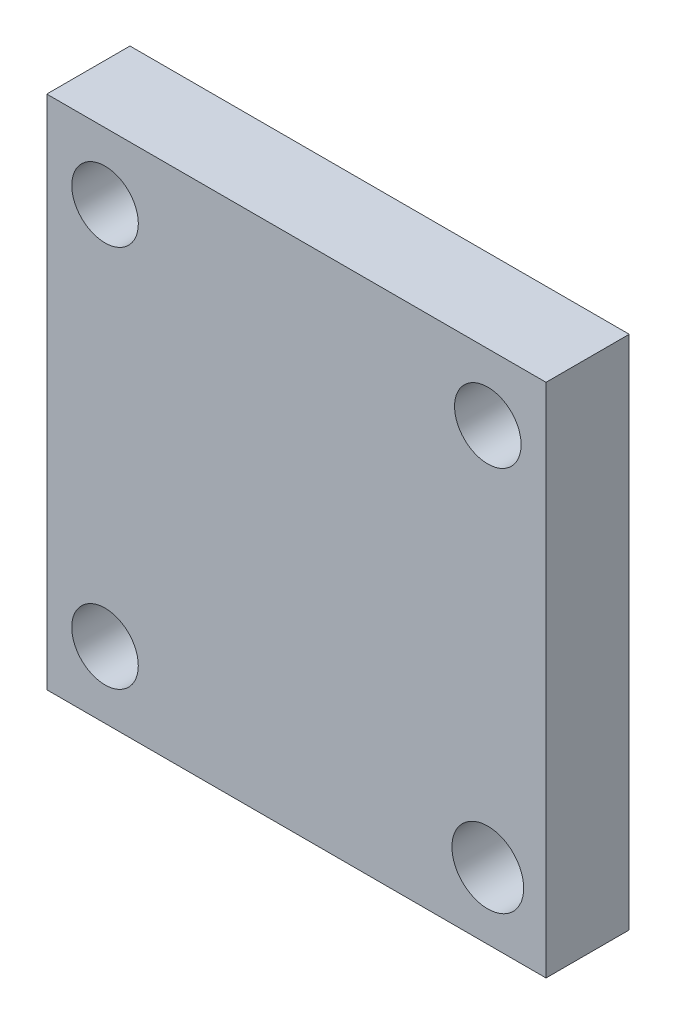
ISO-10303-21;
HEADER;
FILE_DESCRIPTION(('STEP AP214'),'2;1');
FILE_NAME('part.step','',(''),(''),'','','');
FILE_SCHEMA(('AUTOMOTIVE_DESIGN { 1 0 10303 214 1 1 1 1 }'));
ENDSEC;
DATA;
#1=APPLICATION_CONTEXT('core data for automotive mechanical design processes');
#2=APPLICATION_PROTOCOL_DEFINITION('international standard','automotive_design',2000,#1);
#3=PRODUCT_CONTEXT('',#1,'mechanical');
#4=PRODUCT('Part','Part','',(#3));
#5=PRODUCT_RELATED_PRODUCT_CATEGORY('part','',(#4));
#6=PRODUCT_DEFINITION_FORMATION('','',#4);
#7=PRODUCT_DEFINITION_CONTEXT('part definition',#1,'design');
#8=PRODUCT_DEFINITION('design','',#6,#7);
#9=PRODUCT_DEFINITION_SHAPE('','',#8);
#10=(LENGTH_UNIT() NAMED_UNIT(*) SI_UNIT(.MILLI.,.METRE.));
#11=(NAMED_UNIT(*) PLANE_ANGLE_UNIT() SI_UNIT($,.RADIAN.));
#12=(NAMED_UNIT(*) SI_UNIT($,.STERADIAN.) SOLID_ANGLE_UNIT());
#13=UNCERTAINTY_MEASURE_WITH_UNIT(LENGTH_MEASURE(1.E-05),#10,'distance_accuracy_value','');
#14=(GEOMETRIC_REPRESENTATION_CONTEXT(3) GLOBAL_UNCERTAINTY_ASSIGNED_CONTEXT((#13)) GLOBAL_UNIT_ASSIGNED_CONTEXT((#10,
#11,#12)) REPRESENTATION_CONTEXT('',''));
#15=CARTESIAN_POINT('',(0.,0.,0.));
#16=DIRECTION('',(0.,0.,1.));
#17=DIRECTION('',(1.,0.,0.));
#18=AXIS2_PLACEMENT_3D('',#15,#16,#17);
#19=CARTESIAN_POINT('',(0.,0.,5.));
#20=DIRECTION('',(0.,0.,1.));
#21=DIRECTION('',(1.,0.,0.));
#22=AXIS2_PLACEMENT_3D('',#19,#20,#21);
#23=PLANE('',#22);
#24=CARTESIAN_POINT('',(-11.501091744182,-11.4989082558181,5.));
#25=DIRECTION('',(0.,0.,1.));
#26=DIRECTION('',(1.,0.,0.));
#27=AXIS2_PLACEMENT_3D('',#24,#25,#26);
#28=CIRCLE('',#27,2.);
#29=CARTESIAN_POINT('',(-9.50109174418201,-11.4989082558181,5.));
#30=VERTEX_POINT('',#29);
#31=EDGE_CURVE('E142',#30,#30,#28,.T.);
#32=ORIENTED_EDGE('',*,*,#31,.F.);
#33=EDGE_LOOP('',(#32));
#34=FACE_BOUND('',#33,.T.);
#35=CARTESIAN_POINT('',(-11.4989082558179,11.5032752325463,5.));
#36=DIRECTION('',(0.,0.,1.));
#37=DIRECTION('',(1.,0.,0.));
#38=AXIS2_PLACEMENT_3D('',#35,#36,#37);
#39=CIRCLE('',#38,2.);
#40=CARTESIAN_POINT('',(-9.49890825581793,11.5032752325463,5.));
#41=VERTEX_POINT('',#40);
#42=EDGE_CURVE('E112',#41,#41,#39,.T.);
#43=ORIENTED_EDGE('',*,*,#42,.F.);
#44=EDGE_LOOP('',(#43));
#45=FACE_BOUND('',#44,.T.);
#46=DIRECTION('',(0.,1.,0.));
#47=VECTOR('',#46,1.);
#48=CARTESIAN_POINT('',(15.001091744182,-15.5010917441821,5.));
#49=LINE('',#48,#47);
#50=CARTESIAN_POINT('',(15.001091744182,-15.5010917441821,5.));
#51=VERTEX_POINT('',#50);
#52=CARTESIAN_POINT('',(15.001091744182,15.5010917441821,5.));
#53=VERTEX_POINT('',#52);
#54=EDGE_CURVE('E92',#51,#53,#49,.T.);
#55=ORIENTED_EDGE('',*,*,#54,.T.);
#56=DIRECTION('',(-1.,0.,0.));
#57=VECTOR('',#56,1.);
#58=CARTESIAN_POINT('',(15.001091744182,15.5010917441821,5.));
#59=LINE('',#58,#57);
#60=CARTESIAN_POINT('',(-15.001091744182,15.5010917441821,5.));
#61=VERTEX_POINT('',#60);
#62=EDGE_CURVE('E87',#53,#61,#59,.T.);
#63=ORIENTED_EDGE('',*,*,#62,.T.);
#64=DIRECTION('',(0.,-1.,0.));
#65=VECTOR('',#64,1.);
#66=CARTESIAN_POINT('',(-15.001091744182,-15.5010917441821,5.));
#67=LINE('',#66,#65);
#68=CARTESIAN_POINT('',(-15.001091744182,-15.5010917441821,5.));
#69=VERTEX_POINT('',#68);
#70=EDGE_CURVE('E90',#61,#69,#67,.T.);
#71=ORIENTED_EDGE('',*,*,#70,.T.);
#72=DIRECTION('',(1.,0.,0.));
#73=VECTOR('',#72,1.);
#74=CARTESIAN_POINT('',(15.001091744182,-15.5010917441821,5.));
#75=LINE('',#74,#73);
#76=EDGE_CURVE('E57',#69,#51,#75,.T.);
#77=ORIENTED_EDGE('',*,*,#76,.T.);
#78=EDGE_LOOP('',(#55,#63,#71,#77));
#79=FACE_BOUND('',#78,.T.);
#80=CARTESIAN_POINT('',(11.5032752325464,11.5010917441821,5.));
#81=DIRECTION('',(0.,0.,1.));
#82=DIRECTION('',(1.,0.,0.));
#83=AXIS2_PLACEMENT_3D('',#80,#81,#82);
#84=CIRCLE('',#83,2.);
#85=CARTESIAN_POINT('',(13.5032752325464,11.5010917441821,5.));
#86=VERTEX_POINT('',#85);
#87=EDGE_CURVE('E134',#86,#86,#84,.T.);
#88=ORIENTED_EDGE('',*,*,#87,.F.);
#89=EDGE_LOOP('',(#88));
#90=FACE_BOUND('',#89,.T.);
#91=CARTESIAN_POINT('',(11.5010917441823,-11.5010917441821,5.));
#92=DIRECTION('',(0.,0.,1.));
#93=DIRECTION('',(1.,0.,0.));
#94=AXIS2_PLACEMENT_3D('',#91,#92,#93);
#95=CIRCLE('',#94,2.15626689761665);
#96=CARTESIAN_POINT('',(13.657358641799,-11.5010917441821,5.));
#97=VERTEX_POINT('',#96);
#98=EDGE_CURVE('E150',#97,#97,#95,.T.);
#99=ORIENTED_EDGE('',*,*,#98,.F.);
#100=EDGE_LOOP('',(#99));
#101=FACE_BOUND('',#100,.T.);
#102=ADVANCED_FACE('F39',(#34,#45,#79,#90,#101),#23,.T.);
#103=CARTESIAN_POINT('',(0.,0.,0.));
#104=DIRECTION('',(0.,0.,1.));
#105=DIRECTION('',(1.,0.,0.));
#106=AXIS2_PLACEMENT_3D('',#103,#104,#105);
#107=PLANE('',#106);
#108=DIRECTION('',(0.,1.,0.));
#109=VECTOR('',#108,1.);
#110=CARTESIAN_POINT('',(15.001091744182,-15.5010917441821,0.));
#111=LINE('',#110,#109);
#112=CARTESIAN_POINT('',(15.001091744182,-15.5010917441821,0.));
#113=VERTEX_POINT('',#112);
#114=CARTESIAN_POINT('',(15.001091744182,15.5010917441821,0.));
#115=VERTEX_POINT('',#114);
#116=EDGE_CURVE('E108',#113,#115,#111,.T.);
#117=ORIENTED_EDGE('',*,*,#116,.F.);
#118=DIRECTION('',(1.,0.,0.));
#119=VECTOR('',#118,1.);
#120=CARTESIAN_POINT('',(15.001091744182,-15.5010917441821,0.));
#121=LINE('',#120,#119);
#122=CARTESIAN_POINT('',(-15.001091744182,-15.5010917441821,0.));
#123=VERTEX_POINT('',#122);
#124=EDGE_CURVE('E80',#123,#113,#121,.T.);
#125=ORIENTED_EDGE('',*,*,#124,.F.);
#126=DIRECTION('',(0.,-1.,0.));
#127=VECTOR('',#126,1.);
#128=CARTESIAN_POINT('',(-15.001091744182,-15.5010917441821,0.));
#129=LINE('',#128,#127);
#130=CARTESIAN_POINT('',(-15.001091744182,15.5010917441821,0.));
#131=VERTEX_POINT('',#130);
#132=EDGE_CURVE('E74',#131,#123,#129,.T.);
#133=ORIENTED_EDGE('',*,*,#132,.F.);
#134=DIRECTION('',(-1.,0.,0.));
#135=VECTOR('',#134,1.);
#136=CARTESIAN_POINT('',(15.001091744182,15.5010917441821,0.));
#137=LINE('',#136,#135);
#138=EDGE_CURVE('E97',#115,#131,#137,.T.);
#139=ORIENTED_EDGE('',*,*,#138,.F.);
#140=EDGE_LOOP('',(#117,#125,#133,#139));
#141=FACE_BOUND('',#140,.T.);
#142=CARTESIAN_POINT('',(-11.4989082558179,11.5032752325463,0.));
#143=DIRECTION('',(0.,0.,1.));
#144=DIRECTION('',(1.,0.,0.));
#145=AXIS2_PLACEMENT_3D('',#142,#143,#144);
#146=CIRCLE('',#145,2.);
#147=CARTESIAN_POINT('',(-9.49890825581793,11.5032752325463,0.));
#148=VERTEX_POINT('',#147);
#149=EDGE_CURVE('E130',#148,#148,#146,.T.);
#150=ORIENTED_EDGE('',*,*,#149,.T.);
#151=EDGE_LOOP('',(#150));
#152=FACE_BOUND('',#151,.T.);
#153=CARTESIAN_POINT('',(11.5032752325464,11.5010917441821,0.));
#154=DIRECTION('',(0.,0.,1.));
#155=DIRECTION('',(1.,0.,0.));
#156=AXIS2_PLACEMENT_3D('',#153,#154,#155);
#157=CIRCLE('',#156,2.);
#158=CARTESIAN_POINT('',(13.5032752325464,11.5010917441821,0.));
#159=VERTEX_POINT('',#158);
#160=EDGE_CURVE('E138',#159,#159,#157,.T.);
#161=ORIENTED_EDGE('',*,*,#160,.T.);
#162=EDGE_LOOP('',(#161));
#163=FACE_BOUND('',#162,.T.);
#164=CARTESIAN_POINT('',(-11.501091744182,-11.4989082558181,0.));
#165=DIRECTION('',(0.,0.,1.));
#166=DIRECTION('',(1.,0.,0.));
#167=AXIS2_PLACEMENT_3D('',#164,#165,#166);
#168=CIRCLE('',#167,2.);
#169=CARTESIAN_POINT('',(-9.50109174418201,-11.4989082558181,0.));
#170=VERTEX_POINT('',#169);
#171=EDGE_CURVE('E146',#170,#170,#168,.T.);
#172=ORIENTED_EDGE('',*,*,#171,.T.);
#173=EDGE_LOOP('',(#172));
#174=FACE_BOUND('',#173,.T.);
#175=CARTESIAN_POINT('',(11.5010917441823,-11.5010917441821,0.));
#176=DIRECTION('',(0.,0.,1.));
#177=DIRECTION('',(1.,0.,0.));
#178=AXIS2_PLACEMENT_3D('',#175,#176,#177);
#179=CIRCLE('',#178,2.15626689761665);
#180=CARTESIAN_POINT('',(13.657358641799,-11.5010917441821,0.));
#181=VERTEX_POINT('',#180);
#182=EDGE_CURVE('E154',#181,#181,#179,.T.);
#183=ORIENTED_EDGE('',*,*,#182,.T.);
#184=EDGE_LOOP('',(#183));
#185=FACE_BOUND('',#184,.T.);
#186=ADVANCED_FACE('F125',(#141,#152,#163,#174,#185),#107,.F.);
#187=CARTESIAN_POINT('',(15.001091744182,-15.5010917441821,5.));
#188=DIRECTION('',(-1.,0.,0.));
#189=DIRECTION('',(0.,0.,1.));
#190=AXIS2_PLACEMENT_3D('',#187,#188,#189);
#191=PLANE('',#190);
#192=ORIENTED_EDGE('',*,*,#116,.T.);
#193=DIRECTION('',(0.,0.,-1.));
#194=VECTOR('',#193,1.);
#195=CARTESIAN_POINT('',(15.001091744182,15.5010917441821,5.));
#196=LINE('',#195,#194);
#197=EDGE_CURVE('E11',#53,#115,#196,.T.);
#198=ORIENTED_EDGE('',*,*,#197,.F.);
#199=ORIENTED_EDGE('',*,*,#54,.F.);
#200=DIRECTION('',(0.,0.,-1.));
#201=VECTOR('',#200,1.);
#202=CARTESIAN_POINT('',(15.001091744182,-15.5010917441821,5.));
#203=LINE('',#202,#201);
#204=EDGE_CURVE('E104',#51,#113,#203,.T.);
#205=ORIENTED_EDGE('',*,*,#204,.T.);
#206=EDGE_LOOP('',(#192,#198,#199,#205));
#207=FACE_BOUND('',#206,.T.);
#208=ADVANCED_FACE('F41',(#207),#191,.F.);
#209=CARTESIAN_POINT('',(15.001091744182,15.5010917441821,5.));
#210=DIRECTION('',(0.,-1.,0.));
#211=DIRECTION('',(1.,0.,0.));
#212=AXIS2_PLACEMENT_3D('',#209,#210,#211);
#213=PLANE('',#212);
#214=ORIENTED_EDGE('',*,*,#138,.T.);
#215=DIRECTION('',(0.,0.,-1.));
#216=VECTOR('',#215,1.);
#217=CARTESIAN_POINT('',(-15.001091744182,15.5010917441821,5.));
#218=LINE('',#217,#216);
#219=EDGE_CURVE('E49',#61,#131,#218,.T.);
#220=ORIENTED_EDGE('',*,*,#219,.F.);
#221=ORIENTED_EDGE('',*,*,#62,.F.);
#222=ORIENTED_EDGE('',*,*,#197,.T.);
#223=EDGE_LOOP('',(#214,#220,#221,#222));
#224=FACE_BOUND('',#223,.T.);
#225=ADVANCED_FACE('F96',(#224),#213,.F.);
#226=CARTESIAN_POINT('',(-15.001091744182,-15.5010917441821,5.));
#227=DIRECTION('',(1.,0.,0.));
#228=DIRECTION('',(0.,0.,-1.));
#229=AXIS2_PLACEMENT_3D('',#226,#227,#228);
#230=PLANE('',#229);
#231=ORIENTED_EDGE('',*,*,#132,.T.);
#232=DIRECTION('',(0.,0.,-1.));
#233=VECTOR('',#232,1.);
#234=CARTESIAN_POINT('',(-15.001091744182,-15.5010917441821,5.));
#235=LINE('',#234,#233);
#236=EDGE_CURVE('E99',#69,#123,#235,.T.);
#237=ORIENTED_EDGE('',*,*,#236,.F.);
#238=ORIENTED_EDGE('',*,*,#70,.F.);
#239=ORIENTED_EDGE('',*,*,#219,.T.);
#240=EDGE_LOOP('',(#231,#237,#238,#239));
#241=FACE_BOUND('',#240,.T.);
#242=ADVANCED_FACE('F100',(#241),#230,.F.);
#243=CARTESIAN_POINT('',(15.001091744182,-15.5010917441821,5.));
#244=DIRECTION('',(0.,1.,0.));
#245=DIRECTION('',(-1.,0.,0.));
#246=AXIS2_PLACEMENT_3D('',#243,#244,#245);
#247=PLANE('',#246);
#248=ORIENTED_EDGE('',*,*,#124,.T.);
#249=ORIENTED_EDGE('',*,*,#204,.F.);
#250=ORIENTED_EDGE('',*,*,#76,.F.);
#251=ORIENTED_EDGE('',*,*,#236,.T.);
#252=EDGE_LOOP('',(#248,#249,#250,#251));
#253=FACE_BOUND('',#252,.T.);
#254=ADVANCED_FACE('F122',(#253),#247,.F.);
#255=CARTESIAN_POINT('',(-11.4989082558179,11.5032752325463,5.));
#256=DIRECTION('',(0.,0.,-1.));
#257=DIRECTION('',(-1.,0.,0.));
#258=AXIS2_PLACEMENT_3D('',#255,#256,#257);
#259=CYLINDRICAL_SURFACE('',#258,2.);
#260=ORIENTED_EDGE('',*,*,#42,.T.);
#261=EDGE_LOOP('',(#260));
#262=FACE_BOUND('',#261,.T.);
#263=ORIENTED_EDGE('',*,*,#149,.F.);
#264=EDGE_LOOP('',(#263));
#265=FACE_BOUND('',#264,.T.);
#266=ADVANCED_FACE('F175',(#262,#265),#259,.F.);
#267=CARTESIAN_POINT('',(11.5032752325464,11.5010917441821,5.));
#268=DIRECTION('',(0.,0.,-1.));
#269=DIRECTION('',(-1.,0.,0.));
#270=AXIS2_PLACEMENT_3D('',#267,#268,#269);
#271=CYLINDRICAL_SURFACE('',#270,2.);
#272=ORIENTED_EDGE('',*,*,#87,.T.);
#273=EDGE_LOOP('',(#272));
#274=FACE_BOUND('',#273,.T.);
#275=ORIENTED_EDGE('',*,*,#160,.F.);
#276=EDGE_LOOP('',(#275));
#277=FACE_BOUND('',#276,.T.);
#278=ADVANCED_FACE('F221',(#274,#277),#271,.F.);
#279=CARTESIAN_POINT('',(-11.501091744182,-11.4989082558181,5.));
#280=DIRECTION('',(0.,0.,-1.));
#281=DIRECTION('',(-1.,0.,0.));
#282=AXIS2_PLACEMENT_3D('',#279,#280,#281);
#283=CYLINDRICAL_SURFACE('',#282,2.);
#284=ORIENTED_EDGE('',*,*,#31,.T.);
#285=EDGE_LOOP('',(#284));
#286=FACE_BOUND('',#285,.T.);
#287=ORIENTED_EDGE('',*,*,#171,.F.);
#288=EDGE_LOOP('',(#287));
#289=FACE_BOUND('',#288,.T.);
#290=ADVANCED_FACE('F229',(#286,#289),#283,.F.);
#291=CARTESIAN_POINT('',(11.5010917441823,-11.5010917441821,5.));
#292=DIRECTION('',(0.,0.,-1.));
#293=DIRECTION('',(-1.,0.,0.));
#294=AXIS2_PLACEMENT_3D('',#291,#292,#293);
#295=CYLINDRICAL_SURFACE('',#294,2.15626689761665);
#296=ORIENTED_EDGE('',*,*,#98,.T.);
#297=EDGE_LOOP('',(#296));
#298=FACE_BOUND('',#297,.T.);
#299=ORIENTED_EDGE('',*,*,#182,.F.);
#300=EDGE_LOOP('',(#299));
#301=FACE_BOUND('',#300,.T.);
#302=ADVANCED_FACE('F162',(#298,#301),#295,.F.);
#303=CLOSED_SHELL('',(#102,#186,#208,#225,#242,#254,#266,#278,#290,#302));
#304=MANIFOLD_SOLID_BREP('B2',#303);
#305=ADVANCED_BREP_SHAPE_REPRESENTATION('',(#18,#304),#14);
#306=SHAPE_DEFINITION_REPRESENTATION(#9,#305);
ENDSEC;
END-ISO-10303-21;
